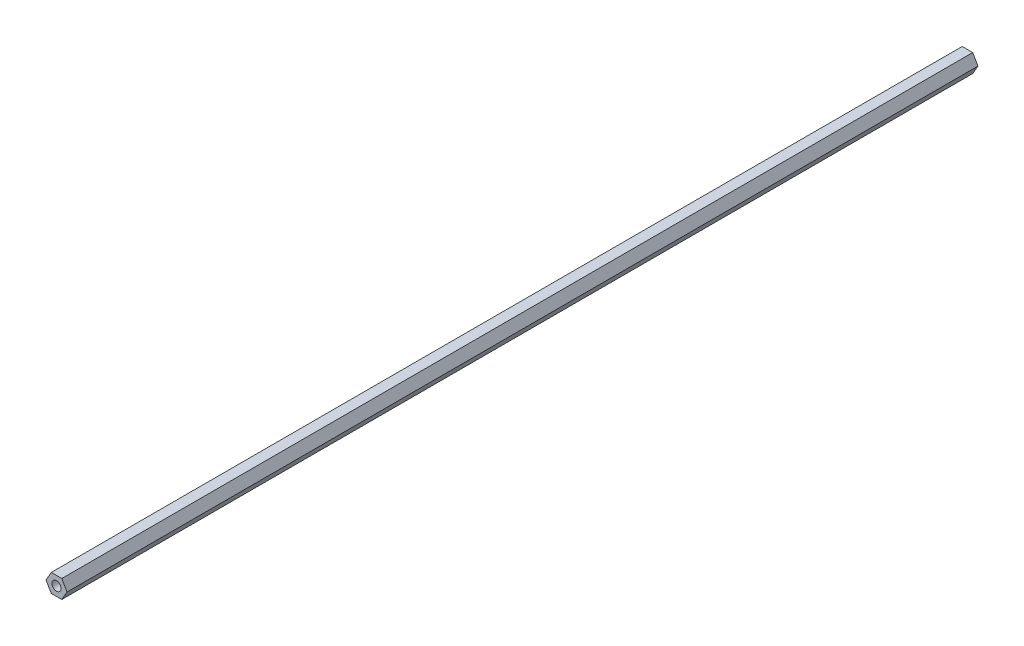
ISO-10303-21;
HEADER;
FILE_DESCRIPTION(('STEP AP214'),'2;1');
FILE_NAME('part.step','',(''),(''),'','','');
FILE_SCHEMA(('AUTOMOTIVE_DESIGN { 1 0 10303 214 1 1 1 1 }'));
ENDSEC;
DATA;
#1=APPLICATION_CONTEXT('core data for automotive mechanical design processes');
#2=APPLICATION_PROTOCOL_DEFINITION('international standard','automotive_design',2000,#1);
#3=PRODUCT_CONTEXT('',#1,'mechanical');
#4=PRODUCT('Part','Part','',(#3));
#5=PRODUCT_RELATED_PRODUCT_CATEGORY('part','',(#4));
#6=PRODUCT_DEFINITION_FORMATION('','',#4);
#7=PRODUCT_DEFINITION_CONTEXT('part definition',#1,'design');
#8=PRODUCT_DEFINITION('design','',#6,#7);
#9=PRODUCT_DEFINITION_SHAPE('','',#8);
#10=(LENGTH_UNIT() NAMED_UNIT(*) SI_UNIT(.MILLI.,.METRE.));
#11=(NAMED_UNIT(*) PLANE_ANGLE_UNIT() SI_UNIT($,.RADIAN.));
#12=(NAMED_UNIT(*) SI_UNIT($,.STERADIAN.) SOLID_ANGLE_UNIT());
#13=UNCERTAINTY_MEASURE_WITH_UNIT(LENGTH_MEASURE(1.E-05),#10,'distance_accuracy_value','');
#14=(GEOMETRIC_REPRESENTATION_CONTEXT(3) GLOBAL_UNCERTAINTY_ASSIGNED_CONTEXT((#13)) GLOBAL_UNIT_ASSIGNED_CONTEXT((#10,
#11,#12)) REPRESENTATION_CONTEXT('',''));
#15=CARTESIAN_POINT('',(0.,0.,0.));
#16=DIRECTION('',(0.,0.,1.));
#17=DIRECTION('',(1.,0.,0.));
#18=AXIS2_PLACEMENT_3D('',#15,#16,#17);
#19=CARTESIAN_POINT('',(0.,0.,635.));
#20=DIRECTION('',(0.,0.,1.));
#21=DIRECTION('',(1.,0.,0.));
#22=AXIS2_PLACEMENT_3D('',#19,#20,#21);
#23=PLANE('',#22);
#24=DIRECTION('',(-1.,0.,0.));
#25=VECTOR('',#24,1.);
#26=CARTESIAN_POINT('',(3.66617420935413,6.35,635.));
#27=LINE('',#26,#25);
#28=CARTESIAN_POINT('',(3.66617420935413,6.35,635.));
#29=VERTEX_POINT('',#28);
#30=CARTESIAN_POINT('',(-3.66617420935412,6.35,635.));
#31=VERTEX_POINT('',#30);
#32=EDGE_CURVE('E137',#29,#31,#27,.T.);
#33=ORIENTED_EDGE('',*,*,#32,.T.);
#34=DIRECTION('',(-0.5,-0.866025403784439,0.));
#35=VECTOR('',#34,1.);
#36=CARTESIAN_POINT('',(-3.66617420935412,6.35,635.));
#37=LINE('',#36,#35);
#38=CARTESIAN_POINT('',(-7.33234841870825,0.,635.));
#39=VERTEX_POINT('',#38);
#40=EDGE_CURVE('E95',#31,#39,#37,.T.);
#41=ORIENTED_EDGE('',*,*,#40,.T.);
#42=DIRECTION('',(0.5,-0.866025403784438,0.));
#43=VECTOR('',#42,1.);
#44=CARTESIAN_POINT('',(-7.33234841870825,0.,635.));
#45=LINE('',#44,#43);
#46=CARTESIAN_POINT('',(-3.66617420935412,-6.35,635.));
#47=VERTEX_POINT('',#46);
#48=EDGE_CURVE('E108',#39,#47,#45,.T.);
#49=ORIENTED_EDGE('',*,*,#48,.T.);
#50=DIRECTION('',(1.,0.,0.));
#51=VECTOR('',#50,1.);
#52=CARTESIAN_POINT('',(-3.66617420935412,-6.35,635.));
#53=LINE('',#52,#51);
#54=CARTESIAN_POINT('',(3.66617420935413,-6.35,635.));
#55=VERTEX_POINT('',#54);
#56=EDGE_CURVE('E102',#47,#55,#53,.T.);
#57=ORIENTED_EDGE('',*,*,#56,.T.);
#58=DIRECTION('',(0.5,0.866025403784439,0.));
#59=VECTOR('',#58,1.);
#60=CARTESIAN_POINT('',(3.66617420935413,-6.35,635.));
#61=LINE('',#60,#59);
#62=CARTESIAN_POINT('',(7.33234841870825,0.,635.));
#63=VERTEX_POINT('',#62);
#64=EDGE_CURVE('E106',#55,#63,#61,.T.);
#65=ORIENTED_EDGE('',*,*,#64,.T.);
#66=DIRECTION('',(-0.5,0.866025403784439,0.));
#67=VECTOR('',#66,1.);
#68=CARTESIAN_POINT('',(7.33234841870825,0.,635.));
#69=LINE('',#68,#67);
#70=EDGE_CURVE('E58',#63,#29,#69,.T.);
#71=ORIENTED_EDGE('',*,*,#70,.T.);
#72=EDGE_LOOP('',(#33,#41,#49,#57,#65,#71));
#73=FACE_BOUND('',#72,.T.);
#74=CARTESIAN_POINT('',(0.,0.,635.));
#75=DIRECTION('',(0.,0.,1.));
#76=DIRECTION('',(1.,0.,0.));
#77=AXIS2_PLACEMENT_3D('',#74,#75,#76);
#78=CIRCLE('',#77,3.175);
#79=CARTESIAN_POINT('',(3.175,0.,635.));
#80=VERTEX_POINT('',#79);
#81=EDGE_CURVE('E130',#80,#80,#78,.T.);
#82=ORIENTED_EDGE('',*,*,#81,.F.);
#83=EDGE_LOOP('',(#82));
#84=FACE_BOUND('',#83,.T.);
#85=ADVANCED_FACE('F41',(#73,#84),#23,.T.);
#86=CARTESIAN_POINT('',(0.,0.,0.));
#87=DIRECTION('',(0.,0.,1.));
#88=DIRECTION('',(1.,0.,0.));
#89=AXIS2_PLACEMENT_3D('',#86,#87,#88);
#90=PLANE('',#89);
#91=DIRECTION('',(-1.,0.,0.));
#92=VECTOR('',#91,1.);
#93=CARTESIAN_POINT('',(3.66617420935413,6.35,0.));
#94=LINE('',#93,#92);
#95=CARTESIAN_POINT('',(3.66617420935413,6.35,0.));
#96=VERTEX_POINT('',#95);
#97=CARTESIAN_POINT('',(-3.66617420935412,6.35,0.));
#98=VERTEX_POINT('',#97);
#99=EDGE_CURVE('E126',#96,#98,#94,.T.);
#100=ORIENTED_EDGE('',*,*,#99,.F.);
#101=DIRECTION('',(-0.5,0.866025403784439,0.));
#102=VECTOR('',#101,1.);
#103=CARTESIAN_POINT('',(7.33234841870825,0.,0.));
#104=LINE('',#103,#102);
#105=CARTESIAN_POINT('',(7.33234841870825,0.,0.));
#106=VERTEX_POINT('',#105);
#107=EDGE_CURVE('E87',#106,#96,#104,.T.);
#108=ORIENTED_EDGE('',*,*,#107,.F.);
#109=DIRECTION('',(0.5,0.866025403784439,0.));
#110=VECTOR('',#109,1.);
#111=CARTESIAN_POINT('',(3.66617420935413,-6.35,0.));
#112=LINE('',#111,#110);
#113=CARTESIAN_POINT('',(3.66617420935413,-6.35,0.));
#114=VERTEX_POINT('',#113);
#115=EDGE_CURVE('E81',#114,#106,#112,.T.);
#116=ORIENTED_EDGE('',*,*,#115,.F.);
#117=DIRECTION('',(1.,0.,0.));
#118=VECTOR('',#117,1.);
#119=CARTESIAN_POINT('',(-3.66617420935412,-6.35,0.));
#120=LINE('',#119,#118);
#121=CARTESIAN_POINT('',(-3.66617420935412,-6.35,0.));
#122=VERTEX_POINT('',#121);
#123=EDGE_CURVE('E116',#122,#114,#120,.T.);
#124=ORIENTED_EDGE('',*,*,#123,.F.);
#125=DIRECTION('',(0.5,-0.866025403784438,0.));
#126=VECTOR('',#125,1.);
#127=CARTESIAN_POINT('',(-7.33234841870825,0.,0.));
#128=LINE('',#127,#126);
#129=CARTESIAN_POINT('',(-7.33234841870825,0.,0.));
#130=VERTEX_POINT('',#129);
#131=EDGE_CURVE('E132',#130,#122,#128,.T.);
#132=ORIENTED_EDGE('',*,*,#131,.F.);
#133=DIRECTION('',(-0.5,-0.866025403784439,0.));
#134=VECTOR('',#133,1.);
#135=CARTESIAN_POINT('',(-3.66617420935412,6.35,0.));
#136=LINE('',#135,#134);
#137=EDGE_CURVE('E129',#98,#130,#136,.T.);
#138=ORIENTED_EDGE('',*,*,#137,.F.);
#139=EDGE_LOOP('',(#100,#108,#116,#124,#132,#138));
#140=FACE_BOUND('',#139,.T.);
#141=CARTESIAN_POINT('',(0.,0.,0.));
#142=DIRECTION('',(0.,0.,1.));
#143=DIRECTION('',(1.,0.,0.));
#144=AXIS2_PLACEMENT_3D('',#141,#142,#143);
#145=CIRCLE('',#144,3.175);
#146=CARTESIAN_POINT('',(3.175,0.,0.));
#147=VERTEX_POINT('',#146);
#148=EDGE_CURVE('E248',#147,#147,#145,.T.);
#149=ORIENTED_EDGE('',*,*,#148,.T.);
#150=EDGE_LOOP('',(#149));
#151=FACE_BOUND('',#150,.T.);
#152=ADVANCED_FACE('F146',(#140,#151),#90,.F.);
#153=CARTESIAN_POINT('',(3.66617420935413,6.35,635.));
#154=DIRECTION('',(0.,-1.,0.));
#155=DIRECTION('',(1.,0.,0.));
#156=AXIS2_PLACEMENT_3D('',#153,#154,#155);
#157=PLANE('',#156);
#158=ORIENTED_EDGE('',*,*,#99,.T.);
#159=DIRECTION('',(0.,0.,-1.));
#160=VECTOR('',#159,1.);
#161=CARTESIAN_POINT('',(-3.66617420935412,6.35,635.));
#162=LINE('',#161,#160);
#163=EDGE_CURVE('E11',#31,#98,#162,.T.);
#164=ORIENTED_EDGE('',*,*,#163,.F.);
#165=ORIENTED_EDGE('',*,*,#32,.F.);
#166=DIRECTION('',(0.,0.,-1.));
#167=VECTOR('',#166,1.);
#168=CARTESIAN_POINT('',(3.66617420935413,6.35,635.));
#169=LINE('',#168,#167);
#170=EDGE_CURVE('E122',#29,#96,#169,.T.);
#171=ORIENTED_EDGE('',*,*,#170,.T.);
#172=EDGE_LOOP('',(#158,#164,#165,#171));
#173=FACE_BOUND('',#172,.T.);
#174=ADVANCED_FACE('F43',(#173),#157,.F.);
#175=CARTESIAN_POINT('',(-3.66617420935412,6.35,635.));
#176=DIRECTION('',(0.866025403784439,-0.5,0.));
#177=DIRECTION('',(0.5,0.866025403784439,0.));
#178=AXIS2_PLACEMENT_3D('',#175,#176,#177);
#179=PLANE('',#178);
#180=ORIENTED_EDGE('',*,*,#137,.T.);
#181=DIRECTION('',(0.,0.,-1.));
#182=VECTOR('',#181,1.);
#183=CARTESIAN_POINT('',(-7.33234841870825,0.,635.));
#184=LINE('',#183,#182);
#185=EDGE_CURVE('E50',#39,#130,#184,.T.);
#186=ORIENTED_EDGE('',*,*,#185,.F.);
#187=ORIENTED_EDGE('',*,*,#40,.F.);
#188=ORIENTED_EDGE('',*,*,#163,.T.);
#189=EDGE_LOOP('',(#180,#186,#187,#188));
#190=FACE_BOUND('',#189,.T.);
#191=ADVANCED_FACE('F171',(#190),#179,.F.);
#192=CARTESIAN_POINT('',(-7.33234841870825,0.,635.));
#193=DIRECTION('',(0.866025403784438,0.5,0.));
#194=DIRECTION('',(-0.5,0.866025403784439,0.));
#195=AXIS2_PLACEMENT_3D('',#192,#193,#194);
#196=PLANE('',#195);
#197=ORIENTED_EDGE('',*,*,#131,.T.);
#198=DIRECTION('',(0.,0.,-1.));
#199=VECTOR('',#198,1.);
#200=CARTESIAN_POINT('',(-3.66617420935412,-6.35,635.));
#201=LINE('',#200,#199);
#202=EDGE_CURVE('E117',#47,#122,#201,.T.);
#203=ORIENTED_EDGE('',*,*,#202,.F.);
#204=ORIENTED_EDGE('',*,*,#48,.F.);
#205=ORIENTED_EDGE('',*,*,#185,.T.);
#206=EDGE_LOOP('',(#197,#203,#204,#205));
#207=FACE_BOUND('',#206,.T.);
#208=ADVANCED_FACE('F143',(#207),#196,.F.);
#209=CARTESIAN_POINT('',(-3.66617420935412,-6.35,635.));
#210=DIRECTION('',(0.,1.,0.));
#211=DIRECTION('',(0.,0.,1.));
#212=AXIS2_PLACEMENT_3D('',#209,#210,#211);
#213=PLANE('',#212);
#214=ORIENTED_EDGE('',*,*,#123,.T.);
#215=DIRECTION('',(0.,0.,-1.));
#216=VECTOR('',#215,1.);
#217=CARTESIAN_POINT('',(3.66617420935413,-6.35,635.));
#218=LINE('',#217,#216);
#219=EDGE_CURVE('E113',#55,#114,#218,.T.);
#220=ORIENTED_EDGE('',*,*,#219,.F.);
#221=ORIENTED_EDGE('',*,*,#56,.F.);
#222=ORIENTED_EDGE('',*,*,#202,.T.);
#223=EDGE_LOOP('',(#214,#220,#221,#222));
#224=FACE_BOUND('',#223,.T.);
#225=ADVANCED_FACE('F114',(#224),#213,.F.);
#226=CARTESIAN_POINT('',(3.66617420935413,-6.35,635.));
#227=DIRECTION('',(-0.866025403784439,0.5,0.));
#228=DIRECTION('',(-0.5,-0.866025403784439,0.));
#229=AXIS2_PLACEMENT_3D('',#226,#227,#228);
#230=PLANE('',#229);
#231=ORIENTED_EDGE('',*,*,#115,.T.);
#232=DIRECTION('',(0.,0.,-1.));
#233=VECTOR('',#232,1.);
#234=CARTESIAN_POINT('',(7.33234841870825,0.,635.));
#235=LINE('',#234,#233);
#236=EDGE_CURVE('E118',#63,#106,#235,.T.);
#237=ORIENTED_EDGE('',*,*,#236,.F.);
#238=ORIENTED_EDGE('',*,*,#64,.F.);
#239=ORIENTED_EDGE('',*,*,#219,.T.);
#240=EDGE_LOOP('',(#231,#237,#238,#239));
#241=FACE_BOUND('',#240,.T.);
#242=ADVANCED_FACE('F120',(#241),#230,.F.);
#243=CARTESIAN_POINT('',(7.33234841870825,0.,635.));
#244=DIRECTION('',(-0.866025403784439,-0.5,0.));
#245=DIRECTION('',(0.5,-0.866025403784439,0.));
#246=AXIS2_PLACEMENT_3D('',#243,#244,#245);
#247=PLANE('',#246);
#248=ORIENTED_EDGE('',*,*,#107,.T.);
#249=ORIENTED_EDGE('',*,*,#170,.F.);
#250=ORIENTED_EDGE('',*,*,#70,.F.);
#251=ORIENTED_EDGE('',*,*,#236,.T.);
#252=EDGE_LOOP('',(#248,#249,#250,#251));
#253=FACE_BOUND('',#252,.T.);
#254=ADVANCED_FACE('F151',(#253),#247,.F.);
#255=CARTESIAN_POINT('',(0.,0.,635.));
#256=DIRECTION('',(0.,0.,-1.));
#257=DIRECTION('',(-1.,0.,0.));
#258=AXIS2_PLACEMENT_3D('',#255,#256,#257);
#259=CYLINDRICAL_SURFACE('',#258,3.175);
#260=ORIENTED_EDGE('',*,*,#81,.T.);
#261=EDGE_LOOP('',(#260));
#262=FACE_BOUND('',#261,.T.);
#263=ORIENTED_EDGE('',*,*,#148,.F.);
#264=EDGE_LOOP('',(#263));
#265=FACE_BOUND('',#264,.T.);
#266=ADVANCED_FACE('F153',(#262,#265),#259,.F.);
#267=CLOSED_SHELL('',(#85,#152,#174,#191,#208,#225,#242,#254,#266));
#268=MANIFOLD_SOLID_BREP('B2',#267);
#269=ADVANCED_BREP_SHAPE_REPRESENTATION('',(#18,#268),#14);
#270=SHAPE_DEFINITION_REPRESENTATION(#9,#269);
ENDSEC;
END-ISO-10303-21;
